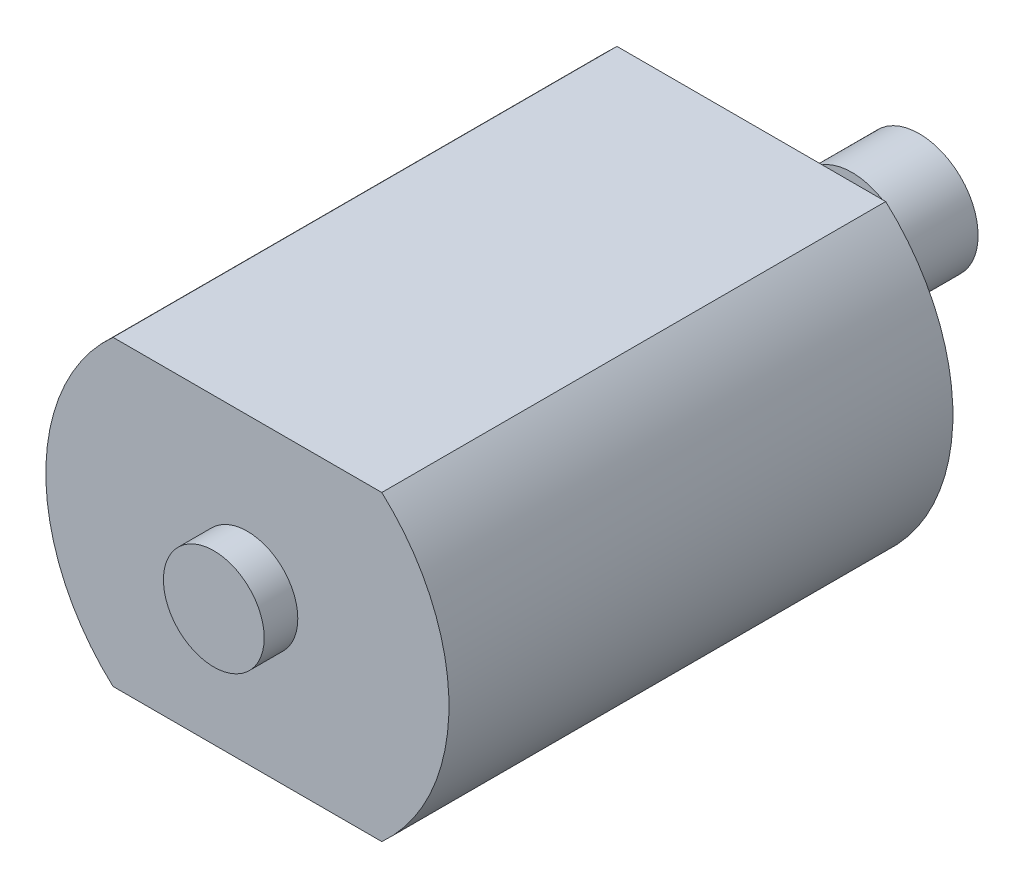
ISO-10303-21;
HEADER;
FILE_DESCRIPTION(('STEP AP214'),'2;1');
FILE_NAME('part.step','',(''),(''),'','','');
FILE_SCHEMA(('AUTOMOTIVE_DESIGN { 1 0 10303 214 1 1 1 1 }'));
ENDSEC;
DATA;
#1=APPLICATION_CONTEXT('core data for automotive mechanical design processes');
#2=APPLICATION_PROTOCOL_DEFINITION('international standard','automotive_design',2000,#1);
#3=PRODUCT_CONTEXT('',#1,'mechanical');
#4=PRODUCT('Part','Part','',(#3));
#5=PRODUCT_RELATED_PRODUCT_CATEGORY('part','',(#4));
#6=PRODUCT_DEFINITION_FORMATION('','',#4);
#7=PRODUCT_DEFINITION_CONTEXT('part definition',#1,'design');
#8=PRODUCT_DEFINITION('design','',#6,#7);
#9=PRODUCT_DEFINITION_SHAPE('','',#8);
#10=(LENGTH_UNIT() NAMED_UNIT(*) SI_UNIT(.MILLI.,.METRE.));
#11=(NAMED_UNIT(*) PLANE_ANGLE_UNIT() SI_UNIT($,.RADIAN.));
#12=(NAMED_UNIT(*) SI_UNIT($,.STERADIAN.) SOLID_ANGLE_UNIT());
#13=UNCERTAINTY_MEASURE_WITH_UNIT(LENGTH_MEASURE(1.E-05),#10,'distance_accuracy_value','');
#14=(GEOMETRIC_REPRESENTATION_CONTEXT(3) GLOBAL_UNCERTAINTY_ASSIGNED_CONTEXT((#13)) GLOBAL_UNIT_ASSIGNED_CONTEXT((#10,
#11,#12)) REPRESENTATION_CONTEXT('',''));
#15=CARTESIAN_POINT('',(0.,0.,0.));
#16=DIRECTION('',(0.,0.,1.));
#17=DIRECTION('',(1.,0.,0.));
#18=AXIS2_PLACEMENT_3D('',#15,#16,#17);
#19=CARTESIAN_POINT('',(0.,0.,-10.));
#20=DIRECTION('',(0.,0.,1.));
#21=DIRECTION('',(1.,0.,0.));
#22=AXIS2_PLACEMENT_3D('',#19,#20,#21);
#23=CYLINDRICAL_SURFACE('',#22,0.75);
#24=CARTESIAN_POINT('',(0.,0.,-0.999999999999999));
#25=DIRECTION('',(0.,0.,-1.));
#26=DIRECTION('',(-1.,0.,0.));
#27=AXIS2_PLACEMENT_3D('',#24,#25,#26);
#28=CIRCLE('',#27,0.75);
#29=CARTESIAN_POINT('',(-0.75,0.,-0.999999999999999));
#30=VERTEX_POINT('',#29);
#31=EDGE_CURVE('E120',#30,#30,#28,.F.);
#32=ORIENTED_EDGE('',*,*,#31,.F.);
#33=EDGE_LOOP('',(#32));
#34=FACE_BOUND('',#33,.T.);
#35=CARTESIAN_POINT('',(0.,0.,-6.));
#36=DIRECTION('',(0.,0.,-1.));
#37=DIRECTION('',(-1.,0.,0.));
#38=AXIS2_PLACEMENT_3D('',#35,#36,#37);
#39=CIRCLE('',#38,0.75);
#40=CARTESIAN_POINT('',(-0.750000000000001,0.,-6.));
#41=VERTEX_POINT('',#40);
#42=EDGE_CURVE('E11',#41,#41,#39,.T.);
#43=ORIENTED_EDGE('',*,*,#42,.F.);
#44=EDGE_LOOP('',(#43));
#45=FACE_BOUND('',#44,.T.);
#46=ADVANCED_FACE('F39',(#34,#45),#23,.T.);
#47=CARTESIAN_POINT('',(-7.99999999999999,9.,30.));
#48=DIRECTION('',(0.,0.,-1.));
#49=DIRECTION('',(-1.,0.,0.));
#50=AXIS2_PLACEMENT_3D('',#47,#48,#49);
#51=PLANE('',#50);
#52=CARTESIAN_POINT('',(0.,0.,30.));
#53=DIRECTION('',(0.,0.,1.));
#54=DIRECTION('',(1.,0.,0.));
#55=AXIS2_PLACEMENT_3D('',#52,#53,#54);
#56=CIRCLE('',#55,3.);
#57=CARTESIAN_POINT('',(3.,0.,30.));
#58=VERTEX_POINT('',#57);
#59=EDGE_CURVE('E49',#58,#58,#56,.T.);
#60=ORIENTED_EDGE('',*,*,#59,.F.);
#61=EDGE_LOOP('',(#60));
#62=FACE_BOUND('',#61,.T.);
#63=DIRECTION('',(1.,0.,0.));
#64=VECTOR('',#63,1.);
#65=CARTESIAN_POINT('',(-7.99999999999999,-9.,30.));
#66=LINE('',#65,#64);
#67=CARTESIAN_POINT('',(-8.,-9.,30.));
#68=VERTEX_POINT('',#67);
#69=CARTESIAN_POINT('',(8.,-9.,30.));
#70=VERTEX_POINT('',#69);
#71=EDGE_CURVE('E69',#68,#70,#66,.T.);
#72=ORIENTED_EDGE('',*,*,#71,.T.);
#73=CARTESIAN_POINT('',(-0.125000000000005,0.,30.));
#74=DIRECTION('',(0.,0.,-1.));
#75=DIRECTION('',(-1.,0.,0.));
#76=AXIS2_PLACEMENT_3D('',#73,#74,#75);
#77=CIRCLE('',#76,12.125);
#78=CARTESIAN_POINT('',(8.,9.,30.));
#79=VERTEX_POINT('',#78);
#80=EDGE_CURVE('E93',#79,#70,#77,.T.);
#81=ORIENTED_EDGE('',*,*,#80,.F.);
#82=DIRECTION('',(1.,0.,0.));
#83=VECTOR('',#82,1.);
#84=CARTESIAN_POINT('',(-7.99999999999999,9.,30.));
#85=LINE('',#84,#83);
#86=CARTESIAN_POINT('',(-7.99999999999999,9.,30.));
#87=VERTEX_POINT('',#86);
#88=EDGE_CURVE('E84',#87,#79,#85,.T.);
#89=ORIENTED_EDGE('',*,*,#88,.F.);
#90=CARTESIAN_POINT('',(0.125000000000005,0.,30.));
#91=DIRECTION('',(0.,0.,-1.));
#92=DIRECTION('',(-1.,0.,0.));
#93=AXIS2_PLACEMENT_3D('',#90,#91,#92);
#94=CIRCLE('',#93,12.125);
#95=EDGE_CURVE('E130',#68,#87,#94,.T.);
#96=ORIENTED_EDGE('',*,*,#95,.F.);
#97=EDGE_LOOP('',(#72,#81,#89,#96));
#98=FACE_BOUND('',#97,.T.);
#99=ADVANCED_FACE('F41',(#62,#98),#51,.F.);
#100=CARTESIAN_POINT('',(-8.,9.,0.));
#101=DIRECTION('',(0.,0.,1.));
#102=DIRECTION('',(1.,0.,0.));
#103=AXIS2_PLACEMENT_3D('',#100,#101,#102);
#104=PLANE('',#103);
#105=CARTESIAN_POINT('',(0.,0.,0.));
#106=DIRECTION('',(0.,0.,-1.));
#107=DIRECTION('',(-1.,0.,0.));
#108=AXIS2_PLACEMENT_3D('',#105,#106,#107);
#109=CIRCLE('',#108,3.);
#110=CARTESIAN_POINT('',(-3.,0.,0.));
#111=VERTEX_POINT('',#110);
#112=EDGE_CURVE('E105',#111,#111,#109,.T.);
#113=ORIENTED_EDGE('',*,*,#112,.F.);
#114=EDGE_LOOP('',(#113));
#115=FACE_BOUND('',#114,.T.);
#116=DIRECTION('',(-1.,0.,0.));
#117=VECTOR('',#116,1.);
#118=CARTESIAN_POINT('',(-8.,-9.,0.));
#119=LINE('',#118,#117);
#120=CARTESIAN_POINT('',(8.,-9.,0.));
#121=VERTEX_POINT('',#120);
#122=CARTESIAN_POINT('',(-8.,-9.,0.));
#123=VERTEX_POINT('',#122);
#124=EDGE_CURVE('E78',#121,#123,#119,.T.);
#125=ORIENTED_EDGE('',*,*,#124,.T.);
#126=CARTESIAN_POINT('',(0.125000000000005,0.,0.));
#127=DIRECTION('',(0.,0.,1.));
#128=DIRECTION('',(1.,0.,0.));
#129=AXIS2_PLACEMENT_3D('',#126,#127,#128);
#130=CIRCLE('',#129,12.125);
#131=CARTESIAN_POINT('',(-8.,9.,0.));
#132=VERTEX_POINT('',#131);
#133=EDGE_CURVE('E123',#132,#123,#130,.T.);
#134=ORIENTED_EDGE('',*,*,#133,.F.);
#135=DIRECTION('',(-1.,0.,0.));
#136=VECTOR('',#135,1.);
#137=CARTESIAN_POINT('',(-8.,9.,0.));
#138=LINE('',#137,#136);
#139=CARTESIAN_POINT('',(8.,9.,0.));
#140=VERTEX_POINT('',#139);
#141=EDGE_CURVE('E57',#140,#132,#138,.T.);
#142=ORIENTED_EDGE('',*,*,#141,.F.);
#143=CARTESIAN_POINT('',(-0.125000000000005,0.,0.));
#144=DIRECTION('',(0.,0.,1.));
#145=DIRECTION('',(-1.,0.,0.));
#146=AXIS2_PLACEMENT_3D('',#143,#144,#145);
#147=CIRCLE('',#146,12.125);
#148=EDGE_CURVE('E97',#121,#140,#147,.T.);
#149=ORIENTED_EDGE('',*,*,#148,.F.);
#150=EDGE_LOOP('',(#125,#134,#142,#149));
#151=FACE_BOUND('',#150,.T.);
#152=ADVANCED_FACE('F161',(#115,#151),#104,.F.);
#153=CARTESIAN_POINT('',(0.,9.,0.));
#154=DIRECTION('',(0.,1.,0.));
#155=DIRECTION('',(0.,0.,1.));
#156=AXIS2_PLACEMENT_3D('',#153,#154,#155);
#157=PLANE('',#156);
#158=DIRECTION('',(0.,0.,1.));
#159=VECTOR('',#158,1.);
#160=CARTESIAN_POINT('',(-8.,9.,0.));
#161=LINE('',#160,#159);
#162=EDGE_CURVE('E88',#132,#87,#161,.T.);
#163=ORIENTED_EDGE('',*,*,#162,.T.);
#164=ORIENTED_EDGE('',*,*,#88,.T.);
#165=DIRECTION('',(0.,0.,-1.));
#166=VECTOR('',#165,1.);
#167=CARTESIAN_POINT('',(8.,9.,0.));
#168=LINE('',#167,#166);
#169=EDGE_CURVE('E87',#79,#140,#168,.T.);
#170=ORIENTED_EDGE('',*,*,#169,.T.);
#171=ORIENTED_EDGE('',*,*,#141,.T.);
#172=EDGE_LOOP('',(#163,#164,#170,#171));
#173=FACE_BOUND('',#172,.T.);
#174=ADVANCED_FACE('F85',(#173),#157,.T.);
#175=CARTESIAN_POINT('',(0.,-9.,0.));
#176=DIRECTION('',(0.,1.,0.));
#177=DIRECTION('',(0.,0.,1.));
#178=AXIS2_PLACEMENT_3D('',#175,#176,#177);
#179=PLANE('',#178);
#180=DIRECTION('',(0.,0.,1.));
#181=VECTOR('',#180,1.);
#182=CARTESIAN_POINT('',(-8.,-9.,0.));
#183=LINE('',#182,#181);
#184=EDGE_CURVE('E109',#123,#68,#183,.T.);
#185=ORIENTED_EDGE('',*,*,#184,.F.);
#186=ORIENTED_EDGE('',*,*,#124,.F.);
#187=DIRECTION('',(0.,0.,-1.));
#188=VECTOR('',#187,1.);
#189=CARTESIAN_POINT('',(8.,-9.,0.));
#190=LINE('',#189,#188);
#191=EDGE_CURVE('E116',#70,#121,#190,.T.);
#192=ORIENTED_EDGE('',*,*,#191,.F.);
#193=ORIENTED_EDGE('',*,*,#71,.F.);
#194=EDGE_LOOP('',(#185,#186,#192,#193));
#195=FACE_BOUND('',#194,.T.);
#196=ADVANCED_FACE('F165',(#195),#179,.F.);
#197=CARTESIAN_POINT('',(0.,0.,-1.));
#198=DIRECTION('',(0.,0.,1.));
#199=DIRECTION('',(1.,0.,0.));
#200=AXIS2_PLACEMENT_3D('',#197,#198,#199);
#201=CYLINDRICAL_SURFACE('',#200,3.);
#202=CARTESIAN_POINT('',(0.,0.,-1.));
#203=DIRECTION('',(0.,0.,-1.));
#204=DIRECTION('',(-1.,0.,0.));
#205=AXIS2_PLACEMENT_3D('',#202,#203,#204);
#206=CIRCLE('',#205,3.);
#207=CARTESIAN_POINT('',(-3.,0.,-0.999999999999999));
#208=VERTEX_POINT('',#207);
#209=EDGE_CURVE('E113',#208,#208,#206,.T.);
#210=ORIENTED_EDGE('',*,*,#209,.F.);
#211=EDGE_LOOP('',(#210));
#212=FACE_BOUND('',#211,.T.);
#213=ORIENTED_EDGE('',*,*,#112,.T.);
#214=EDGE_LOOP('',(#213));
#215=FACE_BOUND('',#214,.T.);
#216=ADVANCED_FACE('F159',(#212,#215),#201,.T.);
#217=CARTESIAN_POINT('',(0.,0.,-1.));
#218=DIRECTION('',(0.,0.,-1.));
#219=DIRECTION('',(-1.,0.,0.));
#220=AXIS2_PLACEMENT_3D('',#217,#218,#219);
#221=PLANE('',#220);
#222=ORIENTED_EDGE('',*,*,#31,.T.);
#223=EDGE_LOOP('',(#222));
#224=FACE_BOUND('',#223,.T.);
#225=ORIENTED_EDGE('',*,*,#209,.T.);
#226=EDGE_LOOP('',(#225));
#227=FACE_BOUND('',#226,.T.);
#228=ADVANCED_FACE('F223',(#224,#227),#221,.T.);
#229=CARTESIAN_POINT('',(0.,0.,32.));
#230=DIRECTION('',(0.,0.,-1.));
#231=DIRECTION('',(-1.,0.,0.));
#232=AXIS2_PLACEMENT_3D('',#229,#230,#231);
#233=CYLINDRICAL_SURFACE('',#232,3.);
#234=CARTESIAN_POINT('',(0.,0.,32.));
#235=DIRECTION('',(0.,0.,1.));
#236=DIRECTION('',(1.,0.,0.));
#237=AXIS2_PLACEMENT_3D('',#234,#235,#236);
#238=CIRCLE('',#237,3.);
#239=CARTESIAN_POINT('',(3.,0.,32.));
#240=VERTEX_POINT('',#239);
#241=EDGE_CURVE('E96',#240,#240,#238,.T.);
#242=ORIENTED_EDGE('',*,*,#241,.F.);
#243=EDGE_LOOP('',(#242));
#244=FACE_BOUND('',#243,.T.);
#245=ORIENTED_EDGE('',*,*,#59,.T.);
#246=EDGE_LOOP('',(#245));
#247=FACE_BOUND('',#246,.T.);
#248=ADVANCED_FACE('F227',(#244,#247),#233,.T.);
#249=CARTESIAN_POINT('',(0.,0.,32.));
#250=DIRECTION('',(0.,0.,1.));
#251=DIRECTION('',(1.,0.,0.));
#252=AXIS2_PLACEMENT_3D('',#249,#250,#251);
#253=PLANE('',#252);
#254=ORIENTED_EDGE('',*,*,#241,.T.);
#255=EDGE_LOOP('',(#254));
#256=FACE_BOUND('',#255,.T.);
#257=ADVANCED_FACE('F177',(#256),#253,.T.);
#258=CARTESIAN_POINT('',(-0.125000000000005,0.,48.4390889145858));
#259=DIRECTION('',(0.,0.,-1.));
#260=DIRECTION('',(-1.,0.,0.));
#261=AXIS2_PLACEMENT_3D('',#258,#259,#260);
#262=CYLINDRICAL_SURFACE('',#261,12.125);
#263=ORIENTED_EDGE('',*,*,#169,.F.);
#264=ORIENTED_EDGE('',*,*,#80,.T.);
#265=ORIENTED_EDGE('',*,*,#191,.T.);
#266=ORIENTED_EDGE('',*,*,#148,.T.);
#267=EDGE_LOOP('',(#263,#264,#265,#266));
#268=FACE_BOUND('',#267,.T.);
#269=ADVANCED_FACE('F100',(#268),#262,.T.);
#270=CARTESIAN_POINT('',(0.125000000000005,0.,48.4390889145858));
#271=DIRECTION('',(0.,0.,-1.));
#272=DIRECTION('',(-1.,0.,0.));
#273=AXIS2_PLACEMENT_3D('',#270,#271,#272);
#274=CYLINDRICAL_SURFACE('',#273,12.125);
#275=ORIENTED_EDGE('',*,*,#184,.T.);
#276=ORIENTED_EDGE('',*,*,#95,.T.);
#277=ORIENTED_EDGE('',*,*,#162,.F.);
#278=ORIENTED_EDGE('',*,*,#133,.T.);
#279=EDGE_LOOP('',(#275,#276,#277,#278));
#280=FACE_BOUND('',#279,.T.);
#281=ADVANCED_FACE('F167',(#280),#274,.T.);
#282=CARTESIAN_POINT('',(0.,0.,-6.));
#283=DIRECTION('',(0.,0.,-1.));
#284=DIRECTION('',(-1.,0.,0.));
#285=AXIS2_PLACEMENT_3D('',#282,#283,#284);
#286=CYLINDRICAL_SURFACE('',#285,3.5);
#287=CARTESIAN_POINT('',(0.,0.,-6.));
#288=DIRECTION('',(0.,0.,-1.));
#289=DIRECTION('',(-1.,0.,0.));
#290=AXIS2_PLACEMENT_3D('',#287,#288,#289);
#291=CIRCLE('',#290,3.5);
#292=CARTESIAN_POINT('',(-3.5,0.,-6.));
#293=VERTEX_POINT('',#292);
#294=EDGE_CURVE('E124',#293,#293,#291,.T.);
#295=ORIENTED_EDGE('',*,*,#294,.T.);
#296=EDGE_LOOP('',(#295));
#297=FACE_BOUND('',#296,.T.);
#298=CARTESIAN_POINT('',(0.,0.,-10.));
#299=DIRECTION('',(0.,0.,-1.));
#300=DIRECTION('',(-1.,0.,0.));
#301=AXIS2_PLACEMENT_3D('',#298,#299,#300);
#302=CIRCLE('',#301,3.5);
#303=CARTESIAN_POINT('',(-3.5,0.,-10.));
#304=VERTEX_POINT('',#303);
#305=EDGE_CURVE('E133',#304,#304,#302,.T.);
#306=ORIENTED_EDGE('',*,*,#305,.F.);
#307=EDGE_LOOP('',(#306));
#308=FACE_BOUND('',#307,.T.);
#309=ADVANCED_FACE('F169',(#297,#308),#286,.T.);
#310=CARTESIAN_POINT('',(0.,0.,-6.));
#311=DIRECTION('',(0.,0.,-1.));
#312=DIRECTION('',(-1.,0.,0.));
#313=AXIS2_PLACEMENT_3D('',#310,#311,#312);
#314=PLANE('',#313);
#315=ORIENTED_EDGE('',*,*,#42,.T.);
#316=EDGE_LOOP('',(#315));
#317=FACE_BOUND('',#316,.T.);
#318=ORIENTED_EDGE('',*,*,#294,.F.);
#319=EDGE_LOOP('',(#318));
#320=FACE_BOUND('',#319,.T.);
#321=ADVANCED_FACE('F175',(#317,#320),#314,.F.);
#322=CARTESIAN_POINT('',(0.,0.,-10.));
#323=DIRECTION('',(0.,0.,-1.));
#324=DIRECTION('',(-1.,0.,0.));
#325=AXIS2_PLACEMENT_3D('',#322,#323,#324);
#326=PLANE('',#325);
#327=ORIENTED_EDGE('',*,*,#305,.T.);
#328=EDGE_LOOP('',(#327));
#329=FACE_BOUND('',#328,.T.);
#330=ADVANCED_FACE('F188',(#329),#326,.T.);
#331=CLOSED_SHELL('',(#46,#99,#152,#174,#196,#216,#228,#248,#257,#269,#281,#309,#321,#330));
#332=MANIFOLD_SOLID_BREP('B2',#331);
#333=ADVANCED_BREP_SHAPE_REPRESENTATION('',(#18,#332),#14);
#334=SHAPE_DEFINITION_REPRESENTATION(#9,#333);
ENDSEC;
END-ISO-10303-21;
